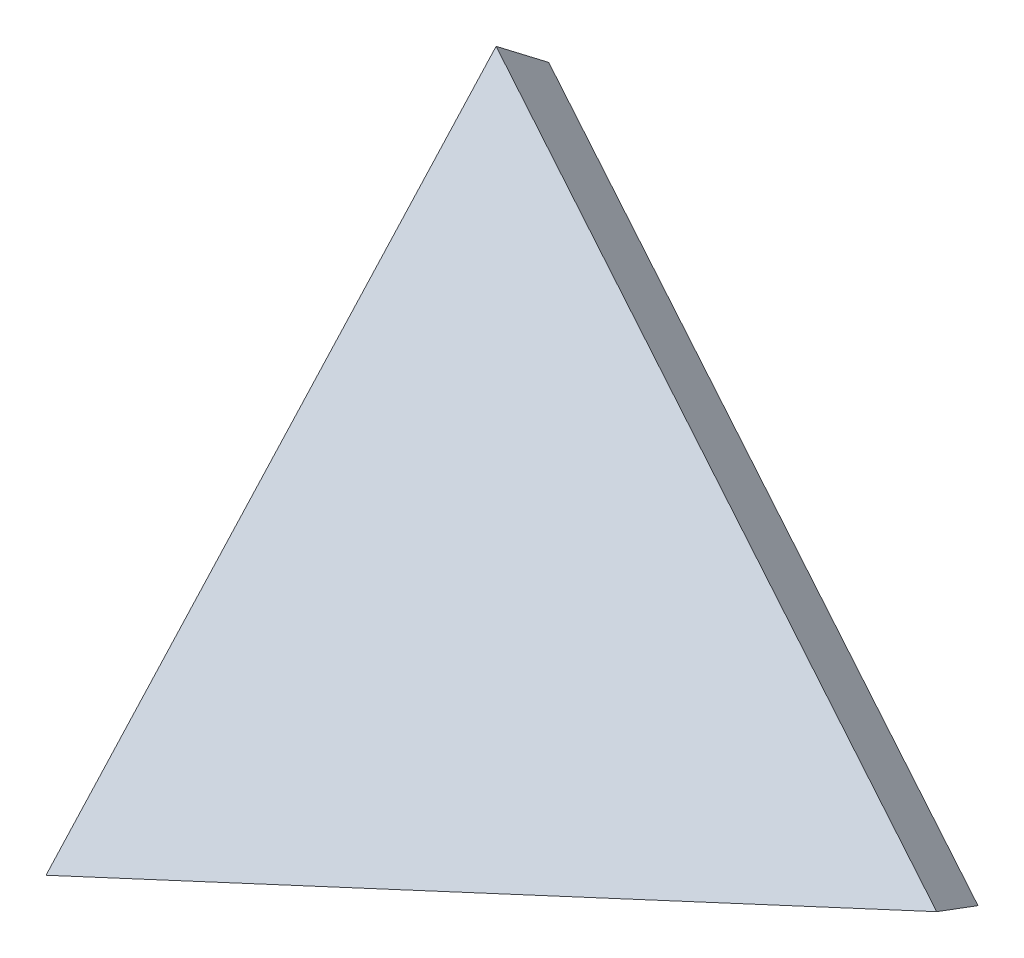
ISO-10303-21;
HEADER;
FILE_DESCRIPTION(('STEP AP214'),'2;1');
FILE_NAME('part.step','',(''),(''),'','','');
FILE_SCHEMA(('AUTOMOTIVE_DESIGN { 1 0 10303 214 1 1 1 1 }'));
ENDSEC;
DATA;
#1=APPLICATION_CONTEXT('core data for automotive mechanical design processes');
#2=APPLICATION_PROTOCOL_DEFINITION('international standard','automotive_design',2000,#1);
#3=PRODUCT_CONTEXT('',#1,'mechanical');
#4=PRODUCT('Part','Part','',(#3));
#5=PRODUCT_RELATED_PRODUCT_CATEGORY('part','',(#4));
#6=PRODUCT_DEFINITION_FORMATION('','',#4);
#7=PRODUCT_DEFINITION_CONTEXT('part definition',#1,'design');
#8=PRODUCT_DEFINITION('design','',#6,#7);
#9=PRODUCT_DEFINITION_SHAPE('','',#8);
#10=(LENGTH_UNIT() NAMED_UNIT(*) SI_UNIT(.MILLI.,.METRE.));
#11=(NAMED_UNIT(*) PLANE_ANGLE_UNIT() SI_UNIT($,.RADIAN.));
#12=(NAMED_UNIT(*) SI_UNIT($,.STERADIAN.) SOLID_ANGLE_UNIT());
#13=UNCERTAINTY_MEASURE_WITH_UNIT(LENGTH_MEASURE(1.E-05),#10,'distance_accuracy_value','');
#14=(GEOMETRIC_REPRESENTATION_CONTEXT(3) GLOBAL_UNCERTAINTY_ASSIGNED_CONTEXT((#13)) GLOBAL_UNIT_ASSIGNED_CONTEXT((#10,
#11,#12)) REPRESENTATION_CONTEXT('',''));
#15=CARTESIAN_POINT('',(0.,0.,0.));
#16=DIRECTION('',(0.,0.,1.));
#17=DIRECTION('',(1.,0.,0.));
#18=AXIS2_PLACEMENT_3D('',#15,#16,#17);
#19=CARTESIAN_POINT('',(-10.8453619509015,-677.135497784857,-1289.47647793373));
#20=DIRECTION('',(-0.00744620257690177,-0.464907313498942,-0.885328043113049));
#21=DIRECTION('',(0.,0.885352588053341,-0.464920202644767));
#22=AXIS2_PLACEMENT_3D('',#19,#20,#21);
#23=PLANE('',#22);
#24=DIRECTION('',(0.175953650278982,0.870929796396141,-0.458826331745332));
#25=VECTOR('',#24,1.);
#26=CARTESIAN_POINT('',(-1548.77124413719,-2289.14360357087,-430.036780540844));
#27=LINE('',#26,#25);
#28=CARTESIAN_POINT('',(-1692.456126474,-3000.35047606479,-55.3562474269819));
#29=VERTEX_POINT('',#28);
#30=CARTESIAN_POINT('',(-1550.53952265277,-2297.89617247244,-425.425721074198));
#31=VERTEX_POINT('',#30);
#32=EDGE_CURVE('E83',#29,#31,#27,.T.);
#33=ORIENTED_EDGE('',*,*,#32,.T.);
#34=DIRECTION('',(0.844141450168812,-0.47754546994405,0.243670958964772));
#35=VECTOR('',#34,1.);
#36=CARTESIAN_POINT('',(-842.09300033859,-2698.67666650113,-220.924634872315));
#37=LINE('',#36,#35);
#38=CARTESIAN_POINT('',(-846.079358792425,-2696.42151433342,-222.075342241358));
#39=VERTEX_POINT('',#38);
#40=EDGE_CURVE('E79',#31,#39,#37,.T.);
#41=ORIENTED_EDGE('',*,*,#40,.T.);
#42=DIRECTION('',(-0.92539069299313,-0.332302401550653,0.182283239068663));
#43=VECTOR('',#42,1.);
#44=CARTESIAN_POINT('',(-1703.38920655302,-3004.27648136624,-53.2026519079321));
#45=LINE('',#44,#43);
#46=EDGE_CURVE('E87',#39,#29,#45,.T.);
#47=ORIENTED_EDGE('',*,*,#46,.T.);
#48=EDGE_LOOP('',(#33,#41,#47));
#49=FACE_BOUND('',#48,.T.);
#50=ADVANCED_FACE('F34',(#49),#23,.T.);
#51=CARTESIAN_POINT('',(-10.3241277705184,-644.591985839931,-1227.50351491581));
#52=DIRECTION('',(-0.00744620257690177,-0.464907313498942,-0.885328043113049));
#53=DIRECTION('',(0.,0.885352588053341,-0.464920202644767));
#54=AXIS2_PLACEMENT_3D('',#51,#52,#53);
#55=PLANE('',#54);
#56=DIRECTION('',(0.175953650278982,0.870929796396141,-0.458826331745332));
#57=VECTOR('',#56,1.);
#58=CARTESIAN_POINT('',(-1700.72442954756,-2976.37500344278,11.1899275771767));
#59=LINE('',#58,#57);
#60=CARTESIAN_POINT('',(-1700.72442954756,-2976.37500344278,11.1899275771767));
#61=VERTEX_POINT('',#60);
#62=CARTESIAN_POINT('',(-1555.08522614839,-2255.49469455111,-368.586799691625));
#63=VERTEX_POINT('',#62);
#64=EDGE_CURVE('E70',#61,#63,#59,.T.);
#65=ORIENTED_EDGE('',*,*,#64,.F.);
#66=DIRECTION('',(-0.92539069299313,-0.332302401550653,0.182283239068663));
#67=VECTOR('',#66,1.);
#68=CARTESIAN_POINT('',(-832.146441478008,-2664.47371293382,-159.902358359867));
#69=LINE('',#68,#67);
#70=CARTESIAN_POINT('',(-832.146441478008,-2664.47371293382,-159.902358359867));
#71=VERTEX_POINT('',#70);
#72=EDGE_CURVE('E72',#71,#61,#69,.T.);
#73=ORIENTED_EDGE('',*,*,#72,.F.);
#74=DIRECTION('',(0.844141450168812,-0.47754546994405,0.243670958964772));
#75=VECTOR('',#74,1.);
#76=CARTESIAN_POINT('',(-1555.08522614839,-2255.49469455111,-368.586799691625));
#77=LINE('',#76,#75);
#78=EDGE_CURVE('E68',#63,#71,#77,.T.);
#79=ORIENTED_EDGE('',*,*,#78,.F.);
#80=EDGE_LOOP('',(#65,#73,#79));
#81=FACE_BOUND('',#80,.T.);
#82=ADVANCED_FACE('F69',(#81),#55,.F.);
#83=CARTESIAN_POINT('',(670.17393599389,-2151.94379802218,-520.746556372785));
#84=DIRECTION('',(0.377110429793499,-0.855412096519447,0.355046291163795));
#85=DIRECTION('',(0.92539069299313,0.332302401550653,-0.182283239068663));
#86=AXIS2_PLACEMENT_3D('',#83,#84,#85);
#87=PLANE('',#86);
#88=ORIENTED_EDGE('',*,*,#46,.F.);
#89=DIRECTION('',(0.195478385233136,0.448226633978716,0.872284979521461));
#90=VECTOR('',#89,1.);
#91=CARTESIAN_POINT('',(-791.361489840341,-2570.95492533112,22.0927029438002));
#92=LINE('',#91,#90);
#93=EDGE_CURVE('E42',#39,#71,#92,.T.);
#94=ORIENTED_EDGE('',*,*,#93,.T.);
#95=ORIENTED_EDGE('',*,*,#72,.T.);
#96=DIRECTION('',(0.116103331439125,-0.336663063687765,-0.934439938132518));
#97=VECTOR('',#96,1.);
#98=CARTESIAN_POINT('',(-1643.27924601084,-3142.94792812856,-451.148862229252));
#99=LINE('',#98,#97);
#100=EDGE_CURVE('E77',#61,#29,#99,.T.);
#101=ORIENTED_EDGE('',*,*,#100,.T.);
#102=EDGE_LOOP('',(#88,#94,#95,#101));
#103=FACE_BOUND('',#102,.T.);
#104=ADVANCED_FACE('F90',(#103),#87,.T.);
#105=CARTESIAN_POINT('',(-1184.74370578233,-487.291642220258,-1379.29483692567));
#106=DIRECTION('',(-0.980297708215344,0.112523845920937,-0.162341576211718));
#107=DIRECTION('',(-0.175953650278982,-0.870929796396141,0.458826331745332));
#108=AXIS2_PLACEMENT_3D('',#105,#106,#107);
#109=PLANE('',#108);
#110=ORIENTED_EDGE('',*,*,#64,.T.);
#111=DIRECTION('',(0.0639719093263752,-0.596718088520931,-0.799896941892556));
#112=VECTOR('',#111,1.);
#113=CARTESIAN_POINT('',(-1569.34872439635,-2122.44743209221,-190.237759474262));
#114=LINE('',#113,#112);
#115=EDGE_CURVE('E11',#63,#31,#114,.T.);
#116=ORIENTED_EDGE('',*,*,#115,.T.);
#117=ORIENTED_EDGE('',*,*,#32,.F.);
#118=ORIENTED_EDGE('',*,*,#100,.F.);
#119=EDGE_LOOP('',(#110,#116,#117,#118));
#120=FACE_BOUND('',#119,.T.);
#121=ADVANCED_FACE('F75',(#120),#109,.T.);
#122=CARTESIAN_POINT('',(-1284.4757041702,-2448.41309260112,-348.623396318659));
#123=DIRECTION('',(0.53294844044482,0.698095076089118,-0.478151884412852));
#124=DIRECTION('',(-0.844141450168812,0.47754546994405,-0.243670958964772));
#125=AXIS2_PLACEMENT_3D('',#122,#123,#124);
#126=PLANE('',#125);
#127=ORIENTED_EDGE('',*,*,#115,.F.);
#128=ORIENTED_EDGE('',*,*,#78,.T.);
#129=ORIENTED_EDGE('',*,*,#93,.F.);
#130=ORIENTED_EDGE('',*,*,#40,.F.);
#131=EDGE_LOOP('',(#127,#128,#129,#130));
#132=FACE_BOUND('',#131,.T.);
#133=ADVANCED_FACE('F36',(#132),#126,.T.);
#134=CLOSED_SHELL('',(#50,#82,#104,#121,#133));
#135=MANIFOLD_SOLID_BREP('B2',#134);
#136=ADVANCED_BREP_SHAPE_REPRESENTATION('',(#18,#135),#14);
#137=SHAPE_DEFINITION_REPRESENTATION(#9,#136);
ENDSEC;
END-ISO-10303-21;
